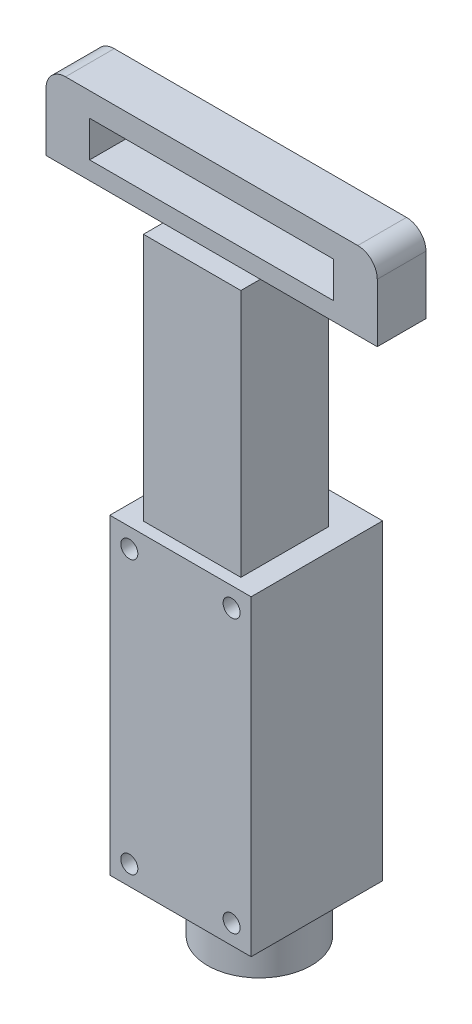
ISO-10303-21;
HEADER;
FILE_DESCRIPTION(('STEP AP214'),'2;1');
FILE_NAME('part.step','',(''),(''),'','','');
FILE_SCHEMA(('AUTOMOTIVE_DESIGN { 1 0 10303 214 1 1 1 1 }'));
ENDSEC;
DATA;
#1=APPLICATION_CONTEXT('core data for automotive mechanical design processes');
#2=APPLICATION_PROTOCOL_DEFINITION('international standard','automotive_design',2000,#1);
#3=PRODUCT_CONTEXT('',#1,'mechanical');
#4=PRODUCT('Part','Part','',(#3));
#5=PRODUCT_RELATED_PRODUCT_CATEGORY('part','',(#4));
#6=PRODUCT_DEFINITION_FORMATION('','',#4);
#7=PRODUCT_DEFINITION_CONTEXT('part definition',#1,'design');
#8=PRODUCT_DEFINITION('design','',#6,#7);
#9=PRODUCT_DEFINITION_SHAPE('','',#8);
#10=(LENGTH_UNIT() NAMED_UNIT(*) SI_UNIT(.MILLI.,.METRE.));
#11=(NAMED_UNIT(*) PLANE_ANGLE_UNIT() SI_UNIT($,.RADIAN.));
#12=(NAMED_UNIT(*) SI_UNIT($,.STERADIAN.) SOLID_ANGLE_UNIT());
#13=UNCERTAINTY_MEASURE_WITH_UNIT(LENGTH_MEASURE(1.E-05),#10,'distance_accuracy_value','');
#14=(GEOMETRIC_REPRESENTATION_CONTEXT(3) GLOBAL_UNCERTAINTY_ASSIGNED_CONTEXT((#13)) GLOBAL_UNIT_ASSIGNED_CONTEXT((#10,
#11,#12)) REPRESENTATION_CONTEXT('',''));
#15=CARTESIAN_POINT('',(0.,0.,0.));
#16=DIRECTION('',(0.,0.,1.));
#17=DIRECTION('',(1.,0.,0.));
#18=AXIS2_PLACEMENT_3D('',#15,#16,#17);
#19=CARTESIAN_POINT('',(10.,83.,-6.9));
#20=DIRECTION('',(-1.,0.,0.));
#21=DIRECTION('',(0.,0.,1.));
#22=AXIS2_PLACEMENT_3D('',#19,#20,#21);
#23=PLANE('',#22);
#24=DIRECTION('',(0.,0.,-1.));
#25=VECTOR('',#24,1.);
#26=CARTESIAN_POINT('',(10.,83.,-2.9));
#27=LINE('',#26,#25);
#28=CARTESIAN_POINT('',(10.,83.,7.1));
#29=VERTEX_POINT('',#28);
#30=CARTESIAN_POINT('',(10.,83.,-2.9));
#31=VERTEX_POINT('',#30);
#32=EDGE_CURVE('E216',#29,#31,#27,.T.);
#33=ORIENTED_EDGE('',*,*,#32,.F.);
#34=DIRECTION('',(0.,0.,-1.));
#35=VECTOR('',#34,1.);
#36=CARTESIAN_POINT('',(10.,83.,-6.9));
#37=LINE('',#36,#35);
#38=CARTESIAN_POINT('',(10.,83.,11.1));
#39=VERTEX_POINT('',#38);
#40=EDGE_CURVE('E262',#39,#29,#37,.T.);
#41=ORIENTED_EDGE('',*,*,#40,.F.);
#42=DIRECTION('',(0.,-1.,0.));
#43=VECTOR('',#42,1.);
#44=CARTESIAN_POINT('',(10.,83.,11.1));
#45=LINE('',#44,#43);
#46=CARTESIAN_POINT('',(10.,32.,11.1));
#47=VERTEX_POINT('',#46);
#48=EDGE_CURVE('E278',#39,#47,#45,.T.);
#49=ORIENTED_EDGE('',*,*,#48,.T.);
#50=DIRECTION('',(0.,0.,-1.));
#51=VECTOR('',#50,1.);
#52=CARTESIAN_POINT('',(10.,32.,-6.9));
#53=LINE('',#52,#51);
#54=CARTESIAN_POINT('',(10.,32.,-6.9));
#55=VERTEX_POINT('',#54);
#56=EDGE_CURVE('E255',#47,#55,#53,.T.);
#57=ORIENTED_EDGE('',*,*,#56,.T.);
#58=DIRECTION('',(0.,-1.,0.));
#59=VECTOR('',#58,1.);
#60=CARTESIAN_POINT('',(10.,83.,-6.9));
#61=LINE('',#60,#59);
#62=CARTESIAN_POINT('',(10.,83.,-6.9));
#63=VERTEX_POINT('',#62);
#64=EDGE_CURVE('E265',#63,#55,#61,.T.);
#65=ORIENTED_EDGE('',*,*,#64,.F.);
#66=EDGE_CURVE('E261',#31,#63,#37,.T.);
#67=ORIENTED_EDGE('',*,*,#66,.F.);
#68=EDGE_LOOP('',(#33,#41,#49,#57,#65,#67));
#69=FACE_BOUND('',#68,.T.);
#70=ADVANCED_FACE('F32',(#69),#23,.F.);
#71=CARTESIAN_POINT('',(0.,83.,0.));
#72=DIRECTION('',(0.,-1.,0.));
#73=DIRECTION('',(0.,0.,-1.));
#74=AXIS2_PLACEMENT_3D('',#71,#72,#73);
#75=PLANE('',#74);
#76=DIRECTION('',(1.,0.,0.));
#77=VECTOR('',#76,1.);
#78=CARTESIAN_POINT('',(10.,83.,7.1));
#79=LINE('',#78,#77);
#80=CARTESIAN_POINT('',(-10.,83.,7.1));
#81=VERTEX_POINT('',#80);
#82=EDGE_CURVE('E246',#81,#29,#79,.T.);
#83=ORIENTED_EDGE('',*,*,#82,.F.);
#84=DIRECTION('',(0.,0.,1.));
#85=VECTOR('',#84,1.);
#86=CARTESIAN_POINT('',(-10.,83.,11.1));
#87=LINE('',#86,#85);
#88=CARTESIAN_POINT('',(-10.,83.,11.1));
#89=VERTEX_POINT('',#88);
#90=EDGE_CURVE('E254',#81,#89,#87,.T.);
#91=ORIENTED_EDGE('',*,*,#90,.T.);
#92=DIRECTION('',(1.,0.,0.));
#93=VECTOR('',#92,1.);
#94=CARTESIAN_POINT('',(10.,83.,11.1));
#95=LINE('',#94,#93);
#96=EDGE_CURVE('E258',#89,#39,#95,.T.);
#97=ORIENTED_EDGE('',*,*,#96,.T.);
#98=ORIENTED_EDGE('',*,*,#40,.T.);
#99=EDGE_LOOP('',(#83,#91,#97,#98));
#100=FACE_BOUND('',#99,.T.);
#101=ADVANCED_FACE('F433',(#100),#75,.F.);
#102=DIRECTION('',(-1.,0.,0.));
#103=VECTOR('',#102,1.);
#104=CARTESIAN_POINT('',(-34.,83.,-2.9));
#105=LINE('',#104,#103);
#106=CARTESIAN_POINT('',(-10.,83.,-2.9));
#107=VERTEX_POINT('',#106);
#108=EDGE_CURVE('E238',#31,#107,#105,.T.);
#109=ORIENTED_EDGE('',*,*,#108,.F.);
#110=ORIENTED_EDGE('',*,*,#66,.T.);
#111=DIRECTION('',(-1.,0.,0.));
#112=VECTOR('',#111,1.);
#113=CARTESIAN_POINT('',(-10.,83.,-6.9));
#114=LINE('',#113,#112);
#115=CARTESIAN_POINT('',(-10.,83.,-6.9));
#116=VERTEX_POINT('',#115);
#117=EDGE_CURVE('E251',#63,#116,#114,.T.);
#118=ORIENTED_EDGE('',*,*,#117,.T.);
#119=EDGE_CURVE('E256',#116,#107,#87,.T.);
#120=ORIENTED_EDGE('',*,*,#119,.T.);
#121=EDGE_LOOP('',(#109,#110,#118,#120));
#122=FACE_BOUND('',#121,.T.);
#123=ADVANCED_FACE('F439',(#122),#75,.F.);
#124=CARTESIAN_POINT('',(-14.5,-32.,-13.5));
#125=DIRECTION('',(0.,-1.,0.));
#126=DIRECTION('',(0.,0.,-1.));
#127=AXIS2_PLACEMENT_3D('',#124,#125,#126);
#128=PLANE('',#127);
#129=CARTESIAN_POINT('',(0.,-32.,-2.7));
#130=DIRECTION('',(0.,-1.,0.));
#131=DIRECTION('',(0.,0.,-1.));
#132=AXIS2_PLACEMENT_3D('',#129,#130,#131);
#133=CIRCLE('',#132,10.65);
#134=CARTESIAN_POINT('',(0.,-32.,-13.35));
#135=VERTEX_POINT('',#134);
#136=EDGE_CURVE('E322',#135,#135,#133,.T.);
#137=ORIENTED_EDGE('',*,*,#136,.F.);
#138=EDGE_LOOP('',(#137));
#139=FACE_BOUND('',#138,.T.);
#140=DIRECTION('',(1.,0.,0.));
#141=VECTOR('',#140,1.);
#142=CARTESIAN_POINT('',(-14.5,-32.,13.5));
#143=LINE('',#142,#141);
#144=CARTESIAN_POINT('',(-14.5,-32.,13.5));
#145=VERTEX_POINT('',#144);
#146=CARTESIAN_POINT('',(14.5,-32.,13.5));
#147=VERTEX_POINT('',#146);
#148=EDGE_CURVE('E287',#145,#147,#143,.T.);
#149=ORIENTED_EDGE('',*,*,#148,.F.);
#150=DIRECTION('',(0.,0.,1.));
#151=VECTOR('',#150,1.);
#152=CARTESIAN_POINT('',(-14.5,-32.,-13.5));
#153=LINE('',#152,#151);
#154=CARTESIAN_POINT('',(-14.5,-32.,-13.5));
#155=VERTEX_POINT('',#154);
#156=EDGE_CURVE('E312',#155,#145,#153,.T.);
#157=ORIENTED_EDGE('',*,*,#156,.F.);
#158=DIRECTION('',(1.,0.,0.));
#159=VECTOR('',#158,1.);
#160=CARTESIAN_POINT('',(-14.5,-32.,-13.5));
#161=LINE('',#160,#159);
#162=CARTESIAN_POINT('',(14.5,-32.,-13.5));
#163=VERTEX_POINT('',#162);
#164=EDGE_CURVE('E288',#155,#163,#161,.T.);
#165=ORIENTED_EDGE('',*,*,#164,.T.);
#166=DIRECTION('',(0.,0.,1.));
#167=VECTOR('',#166,1.);
#168=CARTESIAN_POINT('',(14.5,-32.,-13.5));
#169=LINE('',#168,#167);
#170=EDGE_CURVE('E301',#163,#147,#169,.T.);
#171=ORIENTED_EDGE('',*,*,#170,.T.);
#172=EDGE_LOOP('',(#149,#157,#165,#171));
#173=FACE_BOUND('',#172,.T.);
#174=ADVANCED_FACE('F410',(#139,#173),#128,.T.);
#175=CARTESIAN_POINT('',(-14.5,32.,-13.5));
#176=DIRECTION('',(-1.,0.,0.));
#177=DIRECTION('',(0.,0.,1.));
#178=AXIS2_PLACEMENT_3D('',#175,#176,#177);
#179=PLANE('',#178);
#180=DIRECTION('',(0.,-1.,0.));
#181=VECTOR('',#180,1.);
#182=CARTESIAN_POINT('',(-14.5,32.,13.5));
#183=LINE('',#182,#181);
#184=CARTESIAN_POINT('',(-14.5,32.,13.5));
#185=VERTEX_POINT('',#184);
#186=EDGE_CURVE('E292',#185,#145,#183,.T.);
#187=ORIENTED_EDGE('',*,*,#186,.F.);
#188=DIRECTION('',(0.,0.,1.));
#189=VECTOR('',#188,1.);
#190=CARTESIAN_POINT('',(-14.5,32.,-13.5));
#191=LINE('',#190,#189);
#192=CARTESIAN_POINT('',(-14.5,32.,-13.5));
#193=VERTEX_POINT('',#192);
#194=EDGE_CURVE('E314',#193,#185,#191,.T.);
#195=ORIENTED_EDGE('',*,*,#194,.F.);
#196=DIRECTION('',(0.,-1.,0.));
#197=VECTOR('',#196,1.);
#198=CARTESIAN_POINT('',(-14.5,32.,-13.5));
#199=LINE('',#198,#197);
#200=EDGE_CURVE('E298',#193,#155,#199,.T.);
#201=ORIENTED_EDGE('',*,*,#200,.T.);
#202=ORIENTED_EDGE('',*,*,#156,.T.);
#203=EDGE_LOOP('',(#187,#195,#201,#202));
#204=FACE_BOUND('',#203,.T.);
#205=ADVANCED_FACE('F420',(#204),#179,.T.);
#206=CARTESIAN_POINT('',(14.5,32.,-13.5));
#207=DIRECTION('',(0.,1.,0.));
#208=DIRECTION('',(0.,0.,1.));
#209=AXIS2_PLACEMENT_3D('',#206,#207,#208);
#210=PLANE('',#209);
#211=DIRECTION('',(-1.,0.,0.));
#212=VECTOR('',#211,1.);
#213=CARTESIAN_POINT('',(-10.,32.,-6.9));
#214=LINE('',#213,#212);
#215=CARTESIAN_POINT('',(-10.,32.,-6.9));
#216=VERTEX_POINT('',#215);
#217=EDGE_CURVE('E250',#55,#216,#214,.T.);
#218=ORIENTED_EDGE('',*,*,#217,.F.);
#219=ORIENTED_EDGE('',*,*,#56,.F.);
#220=DIRECTION('',(1.,0.,0.));
#221=VECTOR('',#220,1.);
#222=CARTESIAN_POINT('',(10.,32.,11.1));
#223=LINE('',#222,#221);
#224=CARTESIAN_POINT('',(-10.,32.,11.1));
#225=VERTEX_POINT('',#224);
#226=EDGE_CURVE('E271',#225,#47,#223,.T.);
#227=ORIENTED_EDGE('',*,*,#226,.F.);
#228=DIRECTION('',(0.,0.,1.));
#229=VECTOR('',#228,1.);
#230=CARTESIAN_POINT('',(-10.,32.,11.1));
#231=LINE('',#230,#229);
#232=EDGE_CURVE('E268',#216,#225,#231,.T.);
#233=ORIENTED_EDGE('',*,*,#232,.F.);
#234=EDGE_LOOP('',(#218,#219,#227,#233));
#235=FACE_BOUND('',#234,.T.);
#236=DIRECTION('',(-1.,0.,0.));
#237=VECTOR('',#236,1.);
#238=CARTESIAN_POINT('',(14.5,32.,13.5));
#239=LINE('',#238,#237);
#240=CARTESIAN_POINT('',(14.5,32.,13.5));
#241=VERTEX_POINT('',#240);
#242=EDGE_CURVE('E307',#241,#185,#239,.T.);
#243=ORIENTED_EDGE('',*,*,#242,.F.);
#244=DIRECTION('',(0.,0.,1.));
#245=VECTOR('',#244,1.);
#246=CARTESIAN_POINT('',(14.5,32.,-13.5));
#247=LINE('',#246,#245);
#248=CARTESIAN_POINT('',(14.5,32.,-13.5));
#249=VERTEX_POINT('',#248);
#250=EDGE_CURVE('E316',#249,#241,#247,.T.);
#251=ORIENTED_EDGE('',*,*,#250,.F.);
#252=DIRECTION('',(-1.,0.,0.));
#253=VECTOR('',#252,1.);
#254=CARTESIAN_POINT('',(14.5,32.,-13.5));
#255=LINE('',#254,#253);
#256=EDGE_CURVE('E295',#249,#193,#255,.T.);
#257=ORIENTED_EDGE('',*,*,#256,.T.);
#258=ORIENTED_EDGE('',*,*,#194,.T.);
#259=EDGE_LOOP('',(#243,#251,#257,#258));
#260=FACE_BOUND('',#259,.T.);
#261=ADVANCED_FACE('F418',(#235,#260),#210,.T.);
#262=CARTESIAN_POINT('',(14.5,-32.,-13.5));
#263=DIRECTION('',(1.,0.,0.));
#264=DIRECTION('',(0.,0.,-1.));
#265=AXIS2_PLACEMENT_3D('',#262,#263,#264);
#266=PLANE('',#265);
#267=DIRECTION('',(0.,1.,0.));
#268=VECTOR('',#267,1.);
#269=CARTESIAN_POINT('',(14.5,-32.,13.5));
#270=LINE('',#269,#268);
#271=EDGE_CURVE('E304',#147,#241,#270,.T.);
#272=ORIENTED_EDGE('',*,*,#271,.F.);
#273=ORIENTED_EDGE('',*,*,#170,.F.);
#274=DIRECTION('',(0.,1.,0.));
#275=VECTOR('',#274,1.);
#276=CARTESIAN_POINT('',(14.5,-32.,-13.5));
#277=LINE('',#276,#275);
#278=EDGE_CURVE('E291',#163,#249,#277,.T.);
#279=ORIENTED_EDGE('',*,*,#278,.T.);
#280=ORIENTED_EDGE('',*,*,#250,.T.);
#281=EDGE_LOOP('',(#272,#273,#279,#280));
#282=FACE_BOUND('',#281,.T.);
#283=ADVANCED_FACE('F414',(#282),#266,.T.);
#284=CARTESIAN_POINT('',(0.,0.,-13.5));
#285=DIRECTION('',(0.,0.,1.));
#286=DIRECTION('',(1.,0.,0.));
#287=AXIS2_PLACEMENT_3D('',#284,#285,#286);
#288=PLANE('',#287);
#289=CARTESIAN_POINT('',(-10.5,-28.,-13.5));
#290=DIRECTION('',(0.,0.,1.));
#291=DIRECTION('',(1.,0.,0.));
#292=AXIS2_PLACEMENT_3D('',#289,#290,#291);
#293=CIRCLE('',#292,1.74999999999998);
#294=CARTESIAN_POINT('',(-8.75000000000002,-28.,-13.5));
#295=VERTEX_POINT('',#294);
#296=EDGE_CURVE('E385',#295,#295,#293,.T.);
#297=ORIENTED_EDGE('',*,*,#296,.T.);
#298=EDGE_LOOP('',(#297));
#299=FACE_BOUND('',#298,.T.);
#300=CARTESIAN_POINT('',(10.5,-28.,-13.5));
#301=DIRECTION('',(0.,0.,1.));
#302=DIRECTION('',(1.,0.,0.));
#303=AXIS2_PLACEMENT_3D('',#300,#301,#302);
#304=CIRCLE('',#303,1.74999999999998);
#305=CARTESIAN_POINT('',(12.25,-28.,-13.5));
#306=VERTEX_POINT('',#305);
#307=EDGE_CURVE('E379',#306,#306,#304,.T.);
#308=ORIENTED_EDGE('',*,*,#307,.T.);
#309=EDGE_LOOP('',(#308));
#310=FACE_BOUND('',#309,.T.);
#311=CARTESIAN_POINT('',(-10.5,28.,-13.5));
#312=DIRECTION('',(0.,0.,1.));
#313=DIRECTION('',(1.,0.,0.));
#314=AXIS2_PLACEMENT_3D('',#311,#312,#313);
#315=CIRCLE('',#314,1.74999999999998);
#316=CARTESIAN_POINT('',(-8.75000000000002,28.,-13.5));
#317=VERTEX_POINT('',#316);
#318=EDGE_CURVE('E371',#317,#317,#315,.T.);
#319=ORIENTED_EDGE('',*,*,#318,.T.);
#320=EDGE_LOOP('',(#319));
#321=FACE_BOUND('',#320,.T.);
#322=CARTESIAN_POINT('',(10.5,28.,-13.5));
#323=DIRECTION('',(0.,0.,1.));
#324=DIRECTION('',(1.,0.,0.));
#325=AXIS2_PLACEMENT_3D('',#322,#323,#324);
#326=CIRCLE('',#325,1.74999999999998);
#327=CARTESIAN_POINT('',(12.25,28.,-13.5));
#328=VERTEX_POINT('',#327);
#329=EDGE_CURVE('E363',#328,#328,#326,.T.);
#330=ORIENTED_EDGE('',*,*,#329,.T.);
#331=EDGE_LOOP('',(#330));
#332=FACE_BOUND('',#331,.T.);
#333=ORIENTED_EDGE('',*,*,#164,.F.);
#334=ORIENTED_EDGE('',*,*,#200,.F.);
#335=ORIENTED_EDGE('',*,*,#256,.F.);
#336=ORIENTED_EDGE('',*,*,#278,.F.);
#337=EDGE_LOOP('',(#333,#334,#335,#336));
#338=FACE_BOUND('',#337,.T.);
#339=ADVANCED_FACE('F398',(#299,#310,#321,#332,#338),#288,.F.);
#340=CARTESIAN_POINT('',(0.,0.,13.5));
#341=DIRECTION('',(0.,0.,1.));
#342=DIRECTION('',(1.,0.,0.));
#343=AXIS2_PLACEMENT_3D('',#340,#341,#342);
#344=PLANE('',#343);
#345=CARTESIAN_POINT('',(-10.5,-28.,13.5));
#346=DIRECTION('',(0.,0.,1.));
#347=DIRECTION('',(1.,0.,0.));
#348=AXIS2_PLACEMENT_3D('',#345,#346,#347);
#349=CIRCLE('',#348,1.74999999999999);
#350=CARTESIAN_POINT('',(-8.75000000000001,-28.,13.5));
#351=VERTEX_POINT('',#350);
#352=EDGE_CURVE('E388',#351,#351,#349,.T.);
#353=ORIENTED_EDGE('',*,*,#352,.F.);
#354=EDGE_LOOP('',(#353));
#355=FACE_BOUND('',#354,.T.);
#356=CARTESIAN_POINT('',(10.5,-28.,13.5));
#357=DIRECTION('',(0.,0.,1.));
#358=DIRECTION('',(1.,0.,0.));
#359=AXIS2_PLACEMENT_3D('',#356,#357,#358);
#360=CIRCLE('',#359,1.74999999999999);
#361=CARTESIAN_POINT('',(12.25,-28.,13.5));
#362=VERTEX_POINT('',#361);
#363=EDGE_CURVE('E382',#362,#362,#360,.T.);
#364=ORIENTED_EDGE('',*,*,#363,.F.);
#365=EDGE_LOOP('',(#364));
#366=FACE_BOUND('',#365,.T.);
#367=CARTESIAN_POINT('',(-10.5,28.,13.5));
#368=DIRECTION('',(0.,0.,1.));
#369=DIRECTION('',(1.,0.,0.));
#370=AXIS2_PLACEMENT_3D('',#367,#368,#369);
#371=CIRCLE('',#370,1.74999999999999);
#372=CARTESIAN_POINT('',(-8.75000000000001,28.,13.5));
#373=VERTEX_POINT('',#372);
#374=EDGE_CURVE('E376',#373,#373,#371,.T.);
#375=ORIENTED_EDGE('',*,*,#374,.F.);
#376=EDGE_LOOP('',(#375));
#377=FACE_BOUND('',#376,.T.);
#378=CARTESIAN_POINT('',(10.5,28.,13.5));
#379=DIRECTION('',(0.,0.,1.));
#380=DIRECTION('',(1.,0.,0.));
#381=AXIS2_PLACEMENT_3D('',#378,#379,#380);
#382=CIRCLE('',#381,1.74999999999999);
#383=CARTESIAN_POINT('',(12.25,28.,13.5));
#384=VERTEX_POINT('',#383);
#385=EDGE_CURVE('E367',#384,#384,#382,.T.);
#386=ORIENTED_EDGE('',*,*,#385,.F.);
#387=EDGE_LOOP('',(#386));
#388=FACE_BOUND('',#387,.T.);
#389=ORIENTED_EDGE('',*,*,#148,.T.);
#390=ORIENTED_EDGE('',*,*,#271,.T.);
#391=ORIENTED_EDGE('',*,*,#242,.T.);
#392=ORIENTED_EDGE('',*,*,#186,.T.);
#393=EDGE_LOOP('',(#389,#390,#391,#392));
#394=FACE_BOUND('',#393,.T.);
#395=ADVANCED_FACE('F394',(#355,#366,#377,#388,#394),#344,.T.);
#396=CARTESIAN_POINT('',(-10.,83.,-6.9));
#397=DIRECTION('',(0.,0.,1.));
#398=DIRECTION('',(1.,0.,0.));
#399=AXIS2_PLACEMENT_3D('',#396,#397,#398);
#400=PLANE('',#399);
#401=ORIENTED_EDGE('',*,*,#217,.T.);
#402=DIRECTION('',(0.,-1.,0.));
#403=VECTOR('',#402,1.);
#404=CARTESIAN_POINT('',(-10.,83.,-6.9));
#405=LINE('',#404,#403);
#406=EDGE_CURVE('E284',#116,#216,#405,.T.);
#407=ORIENTED_EDGE('',*,*,#406,.F.);
#408=ORIENTED_EDGE('',*,*,#117,.F.);
#409=ORIENTED_EDGE('',*,*,#64,.T.);
#410=EDGE_LOOP('',(#401,#407,#408,#409));
#411=FACE_BOUND('',#410,.T.);
#412=ADVANCED_FACE('F397',(#411),#400,.F.);
#413=CARTESIAN_POINT('',(-10.,83.,11.1));
#414=DIRECTION('',(1.,0.,0.));
#415=DIRECTION('',(0.,0.,-1.));
#416=AXIS2_PLACEMENT_3D('',#413,#414,#415);
#417=PLANE('',#416);
#418=ORIENTED_EDGE('',*,*,#232,.T.);
#419=DIRECTION('',(0.,-1.,0.));
#420=VECTOR('',#419,1.);
#421=CARTESIAN_POINT('',(-10.,83.,11.1));
#422=LINE('',#421,#420);
#423=EDGE_CURVE('E281',#89,#225,#422,.T.);
#424=ORIENTED_EDGE('',*,*,#423,.F.);
#425=ORIENTED_EDGE('',*,*,#90,.F.);
#426=EDGE_CURVE('E259',#107,#81,#87,.T.);
#427=ORIENTED_EDGE('',*,*,#426,.F.);
#428=ORIENTED_EDGE('',*,*,#119,.F.);
#429=ORIENTED_EDGE('',*,*,#406,.T.);
#430=EDGE_LOOP('',(#418,#424,#425,#427,#428,#429));
#431=FACE_BOUND('',#430,.T.);
#432=ADVANCED_FACE('F447',(#431),#417,.F.);
#433=CARTESIAN_POINT('',(10.,83.,11.1));
#434=DIRECTION('',(0.,0.,-1.));
#435=DIRECTION('',(-1.,0.,0.));
#436=AXIS2_PLACEMENT_3D('',#433,#434,#435);
#437=PLANE('',#436);
#438=ORIENTED_EDGE('',*,*,#226,.T.);
#439=ORIENTED_EDGE('',*,*,#48,.F.);
#440=ORIENTED_EDGE('',*,*,#96,.F.);
#441=ORIENTED_EDGE('',*,*,#423,.T.);
#442=EDGE_LOOP('',(#438,#439,#440,#441));
#443=FACE_BOUND('',#442,.T.);
#444=ADVANCED_FACE('F444',(#443),#437,.F.);
#445=CARTESIAN_POINT('',(-34.,99.,-2.9));
#446=DIRECTION('',(0.,0.,1.));
#447=DIRECTION('',(1.,0.,0.));
#448=AXIS2_PLACEMENT_3D('',#445,#446,#447);
#449=PLANE('',#448);
#450=DIRECTION('',(-1.,0.,0.));
#451=VECTOR('',#450,1.);
#452=CARTESIAN_POINT('',(-34.,94.1,-2.9));
#453=LINE('',#452,#451);
#454=CARTESIAN_POINT('',(25.05,94.1,-2.9));
#455=VERTEX_POINT('',#454);
#456=CARTESIAN_POINT('',(-25.05,94.1,-2.9));
#457=VERTEX_POINT('',#456);
#458=EDGE_CURVE('E210',#455,#457,#453,.T.);
#459=ORIENTED_EDGE('',*,*,#458,.T.);
#460=DIRECTION('',(0.,-1.,0.));
#461=VECTOR('',#460,1.);
#462=CARTESIAN_POINT('',(-25.05,99.,-2.9));
#463=LINE('',#462,#461);
#464=CARTESIAN_POINT('',(-25.05,86.7,-2.9));
#465=VERTEX_POINT('',#464);
#466=EDGE_CURVE('E213',#457,#465,#463,.T.);
#467=ORIENTED_EDGE('',*,*,#466,.T.);
#468=DIRECTION('',(1.,0.,0.));
#469=VECTOR('',#468,1.);
#470=CARTESIAN_POINT('',(-34.,86.7,-2.9));
#471=LINE('',#470,#469);
#472=CARTESIAN_POINT('',(25.05,86.7,-2.9));
#473=VERTEX_POINT('',#472);
#474=EDGE_CURVE('E205',#465,#473,#471,.T.);
#475=ORIENTED_EDGE('',*,*,#474,.T.);
#476=DIRECTION('',(0.,1.,0.));
#477=VECTOR('',#476,1.);
#478=CARTESIAN_POINT('',(25.05,99.,-2.9));
#479=LINE('',#478,#477);
#480=EDGE_CURVE('E180',#473,#455,#479,.T.);
#481=ORIENTED_EDGE('',*,*,#480,.T.);
#482=EDGE_LOOP('',(#459,#467,#475,#481));
#483=FACE_BOUND('',#482,.T.);
#484=DIRECTION('',(0.,-1.,0.));
#485=VECTOR('',#484,1.);
#486=CARTESIAN_POINT('',(-34.,99.,-2.9));
#487=LINE('',#486,#485);
#488=CARTESIAN_POINT('',(-34.,95.,-2.9));
#489=VERTEX_POINT('',#488);
#490=CARTESIAN_POINT('',(-34.,83.,-2.9));
#491=VERTEX_POINT('',#490);
#492=EDGE_CURVE('E248',#489,#491,#487,.T.);
#493=ORIENTED_EDGE('',*,*,#492,.F.);
#494=CARTESIAN_POINT('',(-30.,95.,-2.9));
#495=DIRECTION('',(0.,0.,1.));
#496=DIRECTION('',(1.,0.,0.));
#497=AXIS2_PLACEMENT_3D('',#494,#495,#496);
#498=CIRCLE('',#497,4.);
#499=CARTESIAN_POINT('',(-30.,99.,-2.9));
#500=VERTEX_POINT('',#499);
#501=EDGE_CURVE('E40',#489,#500,#498,.F.);
#502=ORIENTED_EDGE('',*,*,#501,.T.);
#503=DIRECTION('',(-1.,0.,0.));
#504=VECTOR('',#503,1.);
#505=CARTESIAN_POINT('',(-34.,99.,-2.9));
#506=LINE('',#505,#504);
#507=CARTESIAN_POINT('',(30.,99.,-2.9));
#508=VERTEX_POINT('',#507);
#509=EDGE_CURVE('E230',#508,#500,#506,.T.);
#510=ORIENTED_EDGE('',*,*,#509,.F.);
#511=CARTESIAN_POINT('',(30.,95.,-2.9));
#512=DIRECTION('',(0.,0.,1.));
#513=DIRECTION('',(1.,0.,0.));
#514=AXIS2_PLACEMENT_3D('',#511,#512,#513);
#515=CIRCLE('',#514,4.);
#516=CARTESIAN_POINT('',(34.,95.,-2.9));
#517=VERTEX_POINT('',#516);
#518=EDGE_CURVE('E47',#508,#517,#515,.F.);
#519=ORIENTED_EDGE('',*,*,#518,.T.);
#520=DIRECTION('',(0.,1.,0.));
#521=VECTOR('',#520,1.);
#522=CARTESIAN_POINT('',(34.,99.,-2.9));
#523=LINE('',#522,#521);
#524=CARTESIAN_POINT('',(34.,83.,-2.9));
#525=VERTEX_POINT('',#524);
#526=EDGE_CURVE('E221',#525,#517,#523,.T.);
#527=ORIENTED_EDGE('',*,*,#526,.F.);
#528=DIRECTION('',(-1.,0.,0.));
#529=VECTOR('',#528,1.);
#530=CARTESIAN_POINT('',(34.,83.,-2.9));
#531=LINE('',#530,#529);
#532=EDGE_CURVE('E223',#525,#31,#531,.T.);
#533=ORIENTED_EDGE('',*,*,#532,.T.);
#534=ORIENTED_EDGE('',*,*,#108,.T.);
#535=EDGE_CURVE('E229',#107,#491,#105,.T.);
#536=ORIENTED_EDGE('',*,*,#535,.T.);
#537=EDGE_LOOP('',(#493,#502,#510,#519,#527,#533,#534,#536));
#538=FACE_BOUND('',#537,.T.);
#539=ADVANCED_FACE('F331',(#483,#538),#449,.F.);
#540=CARTESIAN_POINT('',(-34.,99.,7.1));
#541=DIRECTION('',(1.,0.,0.));
#542=DIRECTION('',(0.,0.,-1.));
#543=AXIS2_PLACEMENT_3D('',#540,#541,#542);
#544=PLANE('',#543);
#545=DIRECTION('',(0.,-1.,0.));
#546=VECTOR('',#545,1.);
#547=CARTESIAN_POINT('',(-34.,99.,7.1));
#548=LINE('',#547,#546);
#549=CARTESIAN_POINT('',(-34.,95.,7.1));
#550=VERTEX_POINT('',#549);
#551=CARTESIAN_POINT('',(-34.,83.,7.1));
#552=VERTEX_POINT('',#551);
#553=EDGE_CURVE('E237',#550,#552,#548,.T.);
#554=ORIENTED_EDGE('',*,*,#553,.F.);
#555=DIRECTION('',(0.,0.,1.));
#556=VECTOR('',#555,1.);
#557=CARTESIAN_POINT('',(-34.,95.,7.1));
#558=LINE('',#557,#556);
#559=EDGE_CURVE('E55',#550,#489,#558,.F.);
#560=ORIENTED_EDGE('',*,*,#559,.T.);
#561=ORIENTED_EDGE('',*,*,#492,.T.);
#562=DIRECTION('',(0.,0.,1.));
#563=VECTOR('',#562,1.);
#564=CARTESIAN_POINT('',(-34.,83.,7.1));
#565=LINE('',#564,#563);
#566=EDGE_CURVE('E241',#491,#552,#565,.T.);
#567=ORIENTED_EDGE('',*,*,#566,.T.);
#568=EDGE_LOOP('',(#554,#560,#561,#567));
#569=FACE_BOUND('',#568,.T.);
#570=ADVANCED_FACE('F340',(#569),#544,.F.);
#571=CARTESIAN_POINT('',(10.,99.,7.1));
#572=DIRECTION('',(0.,0.,-1.));
#573=DIRECTION('',(-1.,0.,0.));
#574=AXIS2_PLACEMENT_3D('',#571,#572,#573);
#575=PLANE('',#574);
#576=DIRECTION('',(1.,0.,0.));
#577=VECTOR('',#576,1.);
#578=CARTESIAN_POINT('',(-25.05,86.7,7.1));
#579=LINE('',#578,#577);
#580=CARTESIAN_POINT('',(-25.05,86.7,7.1));
#581=VERTEX_POINT('',#580);
#582=CARTESIAN_POINT('',(25.05,86.7,7.1));
#583=VERTEX_POINT('',#582);
#584=EDGE_CURVE('E188',#581,#583,#579,.T.);
#585=ORIENTED_EDGE('',*,*,#584,.F.);
#586=DIRECTION('',(0.,-1.,0.));
#587=VECTOR('',#586,1.);
#588=CARTESIAN_POINT('',(-25.05,94.1,7.1));
#589=LINE('',#588,#587);
#590=CARTESIAN_POINT('',(-25.05,94.1,7.1));
#591=VERTEX_POINT('',#590);
#592=EDGE_CURVE('E193',#591,#581,#589,.T.);
#593=ORIENTED_EDGE('',*,*,#592,.F.);
#594=DIRECTION('',(-1.,0.,0.));
#595=VECTOR('',#594,1.);
#596=CARTESIAN_POINT('',(25.05,94.1,7.1));
#597=LINE('',#596,#595);
#598=CARTESIAN_POINT('',(25.05,94.1,7.1));
#599=VERTEX_POINT('',#598);
#600=EDGE_CURVE('E198',#599,#591,#597,.T.);
#601=ORIENTED_EDGE('',*,*,#600,.F.);
#602=DIRECTION('',(0.,1.,0.));
#603=VECTOR('',#602,1.);
#604=CARTESIAN_POINT('',(25.05,86.7,7.1));
#605=LINE('',#604,#603);
#606=EDGE_CURVE('E177',#583,#599,#605,.T.);
#607=ORIENTED_EDGE('',*,*,#606,.F.);
#608=EDGE_LOOP('',(#585,#593,#601,#607));
#609=FACE_BOUND('',#608,.T.);
#610=DIRECTION('',(1.,0.,0.));
#611=VECTOR('',#610,1.);
#612=CARTESIAN_POINT('',(10.,99.,7.1));
#613=LINE('',#612,#611);
#614=CARTESIAN_POINT('',(-30.,99.,7.1));
#615=VERTEX_POINT('',#614);
#616=CARTESIAN_POINT('',(30.,99.,7.1));
#617=VERTEX_POINT('',#616);
#618=EDGE_CURVE('E233',#615,#617,#613,.T.);
#619=ORIENTED_EDGE('',*,*,#618,.F.);
#620=CARTESIAN_POINT('',(-30.,95.,7.1));
#621=DIRECTION('',(0.,0.,-1.));
#622=DIRECTION('',(-1.,0.,0.));
#623=AXIS2_PLACEMENT_3D('',#620,#621,#622);
#624=CIRCLE('',#623,4.);
#625=EDGE_CURVE('E327',#615,#550,#624,.F.);
#626=ORIENTED_EDGE('',*,*,#625,.T.);
#627=ORIENTED_EDGE('',*,*,#553,.T.);
#628=EDGE_CURVE('E234',#552,#81,#79,.T.);
#629=ORIENTED_EDGE('',*,*,#628,.T.);
#630=ORIENTED_EDGE('',*,*,#82,.T.);
#631=DIRECTION('',(-1.,0.,0.));
#632=VECTOR('',#631,1.);
#633=CARTESIAN_POINT('',(34.,83.,7.1));
#634=LINE('',#633,#632);
#635=CARTESIAN_POINT('',(34.,83.,7.1));
#636=VERTEX_POINT('',#635);
#637=EDGE_CURVE('E227',#636,#29,#634,.T.);
#638=ORIENTED_EDGE('',*,*,#637,.F.);
#639=DIRECTION('',(0.,-1.,0.));
#640=VECTOR('',#639,1.);
#641=CARTESIAN_POINT('',(34.,83.,7.1));
#642=LINE('',#641,#640);
#643=CARTESIAN_POINT('',(34.,95.,7.1));
#644=VERTEX_POINT('',#643);
#645=EDGE_CURVE('E217',#644,#636,#642,.T.);
#646=ORIENTED_EDGE('',*,*,#645,.F.);
#647=CARTESIAN_POINT('',(30.,95.,7.1));
#648=DIRECTION('',(0.,0.,-1.));
#649=DIRECTION('',(-1.,0.,0.));
#650=AXIS2_PLACEMENT_3D('',#647,#648,#649);
#651=CIRCLE('',#650,4.);
#652=EDGE_CURVE('E325',#644,#617,#651,.F.);
#653=ORIENTED_EDGE('',*,*,#652,.T.);
#654=EDGE_LOOP('',(#619,#626,#627,#629,#630,#638,#646,#653));
#655=FACE_BOUND('',#654,.T.);
#656=ADVANCED_FACE('F195',(#609,#655),#575,.F.);
#657=CARTESIAN_POINT('',(0.,99.,0.));
#658=DIRECTION('',(0.,-1.,0.));
#659=DIRECTION('',(0.,0.,-1.));
#660=AXIS2_PLACEMENT_3D('',#657,#658,#659);
#661=PLANE('',#660);
#662=ORIENTED_EDGE('',*,*,#509,.T.);
#663=DIRECTION('',(0.,0.,1.));
#664=VECTOR('',#663,1.);
#665=CARTESIAN_POINT('',(-30.,99.,0.));
#666=LINE('',#665,#664);
#667=EDGE_CURVE('E321',#500,#615,#666,.T.);
#668=ORIENTED_EDGE('',*,*,#667,.T.);
#669=ORIENTED_EDGE('',*,*,#618,.T.);
#670=DIRECTION('',(0.,0.,1.));
#671=VECTOR('',#670,1.);
#672=CARTESIAN_POINT('',(30.,99.,0.));
#673=LINE('',#672,#671);
#674=EDGE_CURVE('E319',#617,#508,#673,.F.);
#675=ORIENTED_EDGE('',*,*,#674,.T.);
#676=EDGE_LOOP('',(#662,#668,#669,#675));
#677=FACE_BOUND('',#676,.T.);
#678=ADVANCED_FACE('F336',(#677),#661,.F.);
#679=CARTESIAN_POINT('',(0.,83.,0.));
#680=DIRECTION('',(0.,-1.,0.));
#681=DIRECTION('',(0.,0.,-1.));
#682=AXIS2_PLACEMENT_3D('',#679,#680,#681);
#683=PLANE('',#682);
#684=ORIENTED_EDGE('',*,*,#535,.F.);
#685=ORIENTED_EDGE('',*,*,#426,.T.);
#686=ORIENTED_EDGE('',*,*,#628,.F.);
#687=ORIENTED_EDGE('',*,*,#566,.F.);
#688=EDGE_LOOP('',(#684,#685,#686,#687));
#689=FACE_BOUND('',#688,.T.);
#690=ADVANCED_FACE('F346',(#689),#683,.T.);
#691=CARTESIAN_POINT('',(34.,83.,-2.9));
#692=DIRECTION('',(0.,1.,0.));
#693=DIRECTION('',(0.,0.,1.));
#694=AXIS2_PLACEMENT_3D('',#691,#692,#693);
#695=PLANE('',#694);
#696=ORIENTED_EDGE('',*,*,#32,.T.);
#697=ORIENTED_EDGE('',*,*,#532,.F.);
#698=DIRECTION('',(0.,0.,-1.));
#699=VECTOR('',#698,1.);
#700=CARTESIAN_POINT('',(34.,83.,-2.9));
#701=LINE('',#700,#699);
#702=EDGE_CURVE('E219',#636,#525,#701,.T.);
#703=ORIENTED_EDGE('',*,*,#702,.F.);
#704=ORIENTED_EDGE('',*,*,#637,.T.);
#705=EDGE_LOOP('',(#696,#697,#703,#704));
#706=FACE_BOUND('',#705,.T.);
#707=ADVANCED_FACE('F468',(#706),#695,.F.);
#708=CARTESIAN_POINT('',(34.,0.,0.));
#709=DIRECTION('',(-1.,0.,0.));
#710=DIRECTION('',(0.,0.,1.));
#711=AXIS2_PLACEMENT_3D('',#708,#709,#710);
#712=PLANE('',#711);
#713=ORIENTED_EDGE('',*,*,#526,.T.);
#714=DIRECTION('',(0.,0.,1.));
#715=VECTOR('',#714,1.);
#716=CARTESIAN_POINT('',(34.,95.,0.));
#717=LINE('',#716,#715);
#718=EDGE_CURVE('E11',#517,#644,#717,.T.);
#719=ORIENTED_EDGE('',*,*,#718,.T.);
#720=ORIENTED_EDGE('',*,*,#645,.T.);
#721=ORIENTED_EDGE('',*,*,#702,.T.);
#722=EDGE_LOOP('',(#713,#719,#720,#721));
#723=FACE_BOUND('',#722,.T.);
#724=ADVANCED_FACE('F471',(#723),#712,.F.);
#725=CARTESIAN_POINT('',(-25.05,94.1,-13.5));
#726=DIRECTION('',(-1.,0.,0.));
#727=DIRECTION('',(0.,0.,1.));
#728=AXIS2_PLACEMENT_3D('',#725,#726,#727);
#729=PLANE('',#728);
#730=DIRECTION('',(0.,0.,1.));
#731=VECTOR('',#730,1.);
#732=CARTESIAN_POINT('',(-25.05,94.1,-13.5));
#733=LINE('',#732,#731);
#734=EDGE_CURVE('E203',#457,#591,#733,.T.);
#735=ORIENTED_EDGE('',*,*,#734,.T.);
#736=ORIENTED_EDGE('',*,*,#592,.T.);
#737=DIRECTION('',(0.,0.,1.));
#738=VECTOR('',#737,1.);
#739=CARTESIAN_POINT('',(-25.05,86.7,-13.5));
#740=LINE('',#739,#738);
#741=EDGE_CURVE('E184',#465,#581,#740,.T.);
#742=ORIENTED_EDGE('',*,*,#741,.F.);
#743=ORIENTED_EDGE('',*,*,#466,.F.);
#744=EDGE_LOOP('',(#735,#736,#742,#743));
#745=FACE_BOUND('',#744,.T.);
#746=ADVANCED_FACE('F605',(#745),#729,.F.);
#747=CARTESIAN_POINT('',(25.05,94.1,-13.5));
#748=DIRECTION('',(0.,1.,0.));
#749=DIRECTION('',(0.,0.,1.));
#750=AXIS2_PLACEMENT_3D('',#747,#748,#749);
#751=PLANE('',#750);
#752=DIRECTION('',(0.,0.,1.));
#753=VECTOR('',#752,1.);
#754=CARTESIAN_POINT('',(25.05,94.1,-13.5));
#755=LINE('',#754,#753);
#756=EDGE_CURVE('E183',#455,#599,#755,.T.);
#757=ORIENTED_EDGE('',*,*,#756,.T.);
#758=ORIENTED_EDGE('',*,*,#600,.T.);
#759=ORIENTED_EDGE('',*,*,#734,.F.);
#760=ORIENTED_EDGE('',*,*,#458,.F.);
#761=EDGE_LOOP('',(#757,#758,#759,#760));
#762=FACE_BOUND('',#761,.T.);
#763=ADVANCED_FACE('F611',(#762),#751,.F.);
#764=CARTESIAN_POINT('',(25.05,86.7,-13.5));
#765=DIRECTION('',(1.,0.,0.));
#766=DIRECTION('',(0.,0.,-1.));
#767=AXIS2_PLACEMENT_3D('',#764,#765,#766);
#768=PLANE('',#767);
#769=DIRECTION('',(0.,0.,1.));
#770=VECTOR('',#769,1.);
#771=CARTESIAN_POINT('',(25.05,86.7,-13.5));
#772=LINE('',#771,#770);
#773=EDGE_CURVE('E172',#473,#583,#772,.T.);
#774=ORIENTED_EDGE('',*,*,#773,.T.);
#775=ORIENTED_EDGE('',*,*,#606,.T.);
#776=ORIENTED_EDGE('',*,*,#756,.F.);
#777=ORIENTED_EDGE('',*,*,#480,.F.);
#778=EDGE_LOOP('',(#774,#775,#776,#777));
#779=FACE_BOUND('',#778,.T.);
#780=ADVANCED_FACE('F174',(#779),#768,.F.);
#781=CARTESIAN_POINT('',(-25.05,86.7,-13.5));
#782=DIRECTION('',(0.,-1.,0.));
#783=DIRECTION('',(0.,0.,-1.));
#784=AXIS2_PLACEMENT_3D('',#781,#782,#783);
#785=PLANE('',#784);
#786=ORIENTED_EDGE('',*,*,#741,.T.);
#787=ORIENTED_EDGE('',*,*,#584,.T.);
#788=ORIENTED_EDGE('',*,*,#773,.F.);
#789=ORIENTED_EDGE('',*,*,#474,.F.);
#790=EDGE_LOOP('',(#786,#787,#788,#789));
#791=FACE_BOUND('',#790,.T.);
#792=ADVANCED_FACE('F189',(#791),#785,.F.);
#793=CARTESIAN_POINT('',(0.,-32.,-2.7));
#794=DIRECTION('',(0.,-1.,0.));
#795=DIRECTION('',(0.,0.,-1.));
#796=AXIS2_PLACEMENT_3D('',#793,#794,#795);
#797=CYLINDRICAL_SURFACE('',#796,10.65);
#798=ORIENTED_EDGE('',*,*,#136,.T.);
#799=EDGE_LOOP('',(#798));
#800=FACE_BOUND('',#799,.T.);
#801=CARTESIAN_POINT('',(0.,-43.6,-2.7));
#802=DIRECTION('',(0.,-1.,0.));
#803=DIRECTION('',(0.,0.,-1.));
#804=AXIS2_PLACEMENT_3D('',#801,#802,#803);
#805=CIRCLE('',#804,10.65);
#806=CARTESIAN_POINT('',(0.,-43.6,-13.35));
#807=VERTEX_POINT('',#806);
#808=EDGE_CURVE('E359',#807,#807,#805,.T.);
#809=ORIENTED_EDGE('',*,*,#808,.F.);
#810=EDGE_LOOP('',(#809));
#811=FACE_BOUND('',#810,.T.);
#812=ADVANCED_FACE('F631',(#800,#811),#797,.T.);
#813=CARTESIAN_POINT('',(0.,-43.6,-2.7));
#814=DIRECTION('',(0.,-1.,0.));
#815=DIRECTION('',(0.,0.,-1.));
#816=AXIS2_PLACEMENT_3D('',#813,#814,#815);
#817=PLANE('',#816);
#818=ORIENTED_EDGE('',*,*,#808,.T.);
#819=EDGE_LOOP('',(#818));
#820=FACE_BOUND('',#819,.T.);
#821=ADVANCED_FACE('F638',(#820),#817,.T.);
#822=CARTESIAN_POINT('',(10.5,28.,13.5));
#823=DIRECTION('',(0.,0.,1.));
#824=DIRECTION('',(1.,0.,0.));
#825=AXIS2_PLACEMENT_3D('',#822,#823,#824);
#826=CYLINDRICAL_SURFACE('',#825,1.74999999999999);
#827=ORIENTED_EDGE('',*,*,#329,.F.);
#828=EDGE_LOOP('',(#827));
#829=FACE_BOUND('',#828,.T.);
#830=ORIENTED_EDGE('',*,*,#385,.T.);
#831=EDGE_LOOP('',(#830));
#832=FACE_BOUND('',#831,.T.);
#833=ADVANCED_FACE('F644',(#829,#832),#826,.F.);
#834=CARTESIAN_POINT('',(-10.5,28.,13.5));
#835=DIRECTION('',(0.,0.,1.));
#836=DIRECTION('',(1.,0.,0.));
#837=AXIS2_PLACEMENT_3D('',#834,#835,#836);
#838=CYLINDRICAL_SURFACE('',#837,1.74999999999999);
#839=ORIENTED_EDGE('',*,*,#318,.F.);
#840=EDGE_LOOP('',(#839));
#841=FACE_BOUND('',#840,.T.);
#842=ORIENTED_EDGE('',*,*,#374,.T.);
#843=EDGE_LOOP('',(#842));
#844=FACE_BOUND('',#843,.T.);
#845=ADVANCED_FACE('F650',(#841,#844),#838,.F.);
#846=CARTESIAN_POINT('',(10.5,-28.,13.5));
#847=DIRECTION('',(0.,0.,1.));
#848=DIRECTION('',(1.,0.,0.));
#849=AXIS2_PLACEMENT_3D('',#846,#847,#848);
#850=CYLINDRICAL_SURFACE('',#849,1.74999999999999);
#851=ORIENTED_EDGE('',*,*,#307,.F.);
#852=EDGE_LOOP('',(#851));
#853=FACE_BOUND('',#852,.T.);
#854=ORIENTED_EDGE('',*,*,#363,.T.);
#855=EDGE_LOOP('',(#854));
#856=FACE_BOUND('',#855,.T.);
#857=ADVANCED_FACE('F480',(#853,#856),#850,.F.);
#858=CARTESIAN_POINT('',(-10.5,-28.,13.5));
#859=DIRECTION('',(0.,0.,1.));
#860=DIRECTION('',(1.,0.,0.));
#861=AXIS2_PLACEMENT_3D('',#858,#859,#860);
#862=CYLINDRICAL_SURFACE('',#861,1.74999999999999);
#863=ORIENTED_EDGE('',*,*,#296,.F.);
#864=EDGE_LOOP('',(#863));
#865=FACE_BOUND('',#864,.T.);
#866=ORIENTED_EDGE('',*,*,#352,.T.);
#867=EDGE_LOOP('',(#866));
#868=FACE_BOUND('',#867,.T.);
#869=ADVANCED_FACE('F392',(#865,#868),#862,.F.);
#870=CARTESIAN_POINT('',(-30.,95.,0.));
#871=DIRECTION('',(0.,0.,1.));
#872=DIRECTION('',(1.,0.,0.));
#873=AXIS2_PLACEMENT_3D('',#870,#871,#872);
#874=CYLINDRICAL_SURFACE('',#873,4.);
#875=ORIENTED_EDGE('',*,*,#501,.F.);
#876=ORIENTED_EDGE('',*,*,#559,.F.);
#877=ORIENTED_EDGE('',*,*,#625,.F.);
#878=ORIENTED_EDGE('',*,*,#667,.F.);
#879=EDGE_LOOP('',(#875,#876,#877,#878));
#880=FACE_BOUND('',#879,.T.);
#881=ADVANCED_FACE('F339',(#880),#874,.T.);
#882=CARTESIAN_POINT('',(30.,95.,0.));
#883=DIRECTION('',(0.,0.,1.));
#884=DIRECTION('',(1.,0.,0.));
#885=AXIS2_PLACEMENT_3D('',#882,#883,#884);
#886=CYLINDRICAL_SURFACE('',#885,4.);
#887=ORIENTED_EDGE('',*,*,#518,.F.);
#888=ORIENTED_EDGE('',*,*,#674,.F.);
#889=ORIENTED_EDGE('',*,*,#652,.F.);
#890=ORIENTED_EDGE('',*,*,#718,.F.);
#891=EDGE_LOOP('',(#887,#888,#889,#890));
#892=FACE_BOUND('',#891,.T.);
#893=ADVANCED_FACE('F34',(#892),#886,.T.);
#894=CLOSED_SHELL('',(#70,#101,#123,#174,#205,#261,#283,#339,#395,#412,#432,#444,#539,#570,#656,
#678,#690,#707,#724,#746,#763,#780,#792,#812,#821,#833,#845,#857,#869,#881,#893));
#895=MANIFOLD_SOLID_BREP('B2',#894);
#896=ADVANCED_BREP_SHAPE_REPRESENTATION('',(#18,#895),#14);
#897=SHAPE_DEFINITION_REPRESENTATION(#9,#896);
ENDSEC;
END-ISO-10303-21;
